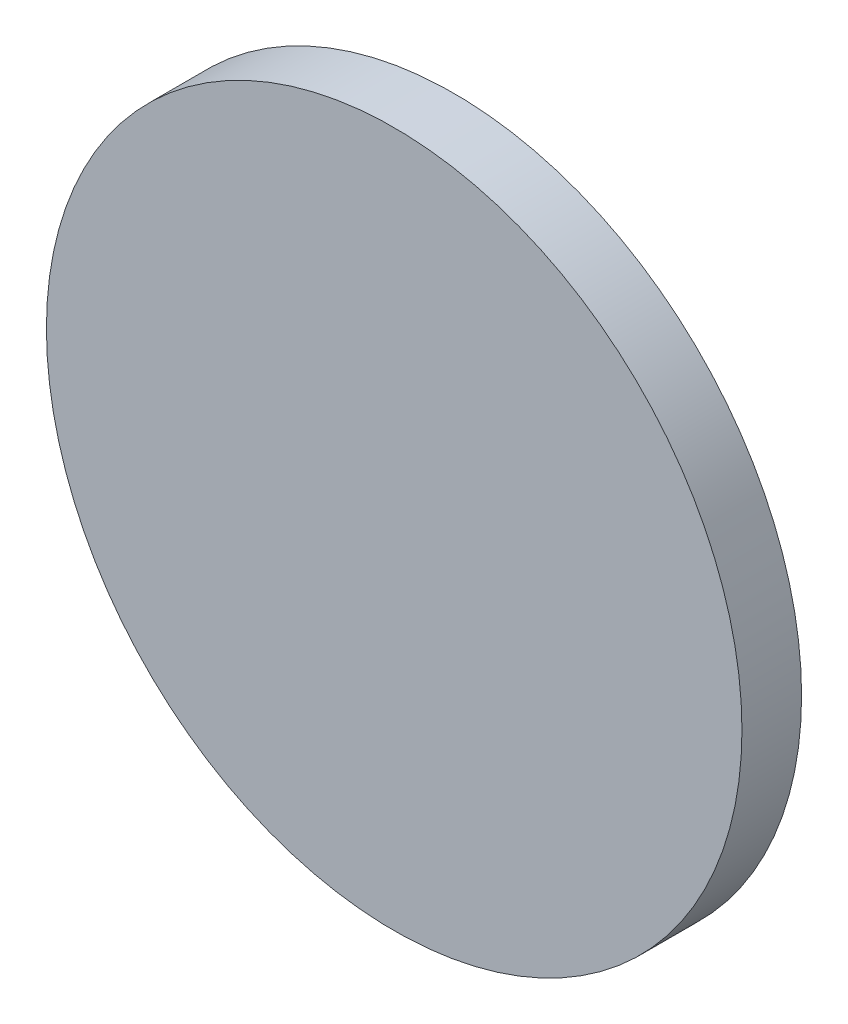
ISO-10303-21;
HEADER;
FILE_DESCRIPTION(('STEP AP214'),'2;1');
FILE_NAME('part.step','',(''),(''),'','','');
FILE_SCHEMA(('AUTOMOTIVE_DESIGN { 1 0 10303 214 1 1 1 1 }'));
ENDSEC;
DATA;
#1=APPLICATION_CONTEXT('core data for automotive mechanical design processes');
#2=APPLICATION_PROTOCOL_DEFINITION('international standard','automotive_design',2000,#1);
#3=PRODUCT_CONTEXT('',#1,'mechanical');
#4=PRODUCT('Part','Part','',(#3));
#5=PRODUCT_RELATED_PRODUCT_CATEGORY('part','',(#4));
#6=PRODUCT_DEFINITION_FORMATION('','',#4);
#7=PRODUCT_DEFINITION_CONTEXT('part definition',#1,'design');
#8=PRODUCT_DEFINITION('design','',#6,#7);
#9=PRODUCT_DEFINITION_SHAPE('','',#8);
#10=(LENGTH_UNIT() NAMED_UNIT(*) SI_UNIT(.MILLI.,.METRE.));
#11=(NAMED_UNIT(*) PLANE_ANGLE_UNIT() SI_UNIT($,.RADIAN.));
#12=(NAMED_UNIT(*) SI_UNIT($,.STERADIAN.) SOLID_ANGLE_UNIT());
#13=UNCERTAINTY_MEASURE_WITH_UNIT(LENGTH_MEASURE(1.E-05),#10,'distance_accuracy_value','');
#14=(GEOMETRIC_REPRESENTATION_CONTEXT(3) GLOBAL_UNCERTAINTY_ASSIGNED_CONTEXT((#13)) GLOBAL_UNIT_ASSIGNED_CONTEXT((#10,
#11,#12)) REPRESENTATION_CONTEXT('',''));
#15=CARTESIAN_POINT('',(0.,0.,0.));
#16=DIRECTION('',(0.,0.,1.));
#17=DIRECTION('',(1.,0.,0.));
#18=AXIS2_PLACEMENT_3D('',#15,#16,#17);
#19=CARTESIAN_POINT('',(3.03022,2.329180006176,0.03429));
#20=DIRECTION('',(0.,0.,1.));
#21=DIRECTION('',(1.,0.,0.));
#22=AXIS2_PLACEMENT_3D('',#19,#20,#21);
#23=PLANE('',#22);
#24=CARTESIAN_POINT('',(3.03022,2.329180006176,0.03429));
#25=DIRECTION('',(0.,0.,1.));
#26=DIRECTION('',(1.,0.,0.));
#27=AXIS2_PLACEMENT_3D('',#24,#25,#26);
#28=CIRCLE('',#27,0.200024667);
#29=CARTESIAN_POINT('',(3.230244667,2.329180006176,0.03429));
#30=VERTEX_POINT('',#29);
#31=EDGE_CURVE('E18',#30,#30,#28,.F.);
#32=ORIENTED_EDGE('',*,*,#31,.F.);
#33=EDGE_LOOP('',(#32));
#34=FACE_BOUND('',#33,.T.);
#35=ADVANCED_FACE('F15',(#34),#23,.T.);
#36=CARTESIAN_POINT('',(3.03022,2.329180006176,0.));
#37=DIRECTION('',(0.,0.,1.));
#38=DIRECTION('',(1.,0.,0.));
#39=AXIS2_PLACEMENT_3D('',#36,#37,#38);
#40=CYLINDRICAL_SURFACE('',#39,0.200024667);
#41=ORIENTED_EDGE('',*,*,#31,.T.);
#42=EDGE_LOOP('',(#41));
#43=FACE_BOUND('',#42,.T.);
#44=CARTESIAN_POINT('',(3.03022,2.329180006176,0.));
#45=DIRECTION('',(0.,0.,1.));
#46=DIRECTION('',(1.,0.,0.));
#47=AXIS2_PLACEMENT_3D('',#44,#45,#46);
#48=CIRCLE('',#47,0.200024667);
#49=CARTESIAN_POINT('',(3.230244667,2.329180006176,0.));
#50=VERTEX_POINT('',#49);
#51=EDGE_CURVE('E10',#50,#50,#48,.F.);
#52=ORIENTED_EDGE('',*,*,#51,.F.);
#53=EDGE_LOOP('',(#52));
#54=FACE_BOUND('',#53,.T.);
#55=ADVANCED_FACE('F27',(#43,#54),#40,.T.);
#56=CARTESIAN_POINT('',(3.03022,2.329180006176,0.));
#57=DIRECTION('',(0.,0.,-1.));
#58=DIRECTION('',(-1.,0.,0.));
#59=AXIS2_PLACEMENT_3D('',#56,#57,#58);
#60=PLANE('',#59);
#61=ORIENTED_EDGE('',*,*,#51,.T.);
#62=EDGE_LOOP('',(#61));
#63=FACE_BOUND('',#62,.T.);
#64=ADVANCED_FACE('F35',(#63),#60,.T.);
#65=CLOSED_SHELL('',(#35,#55,#64));
#66=MANIFOLD_SOLID_BREP('B1',#65);
#67=ADVANCED_BREP_SHAPE_REPRESENTATION('',(#18,#66),#14);
#68=SHAPE_DEFINITION_REPRESENTATION(#9,#67);
ENDSEC;
END-ISO-10303-21;
